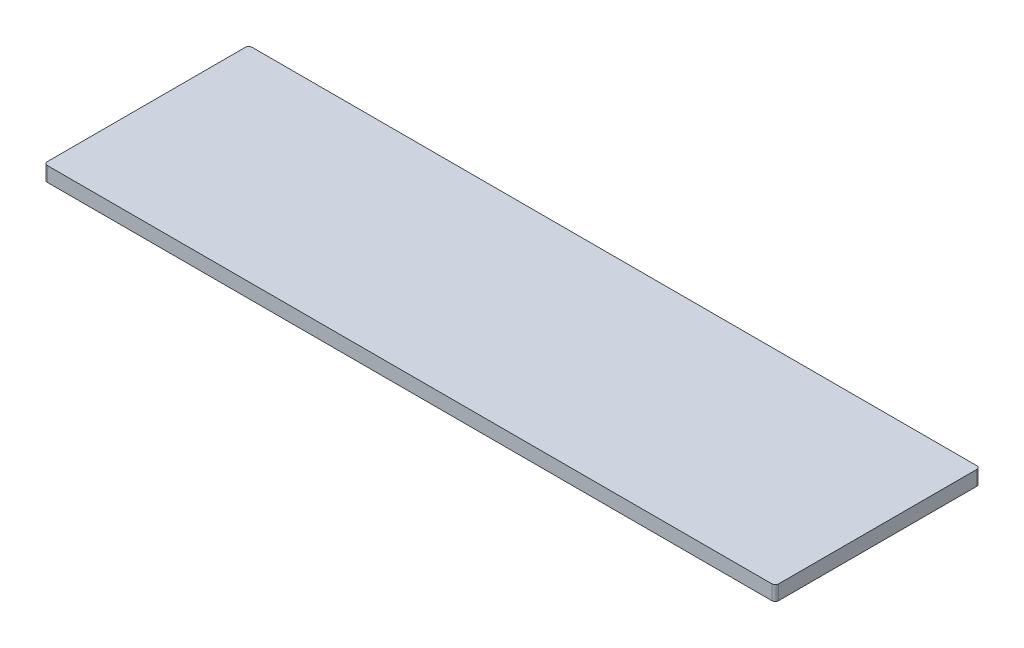
ISO-10303-21;
HEADER;
FILE_DESCRIPTION(('STEP AP214'),'2;1');
FILE_NAME('part.step','',(''),(''),'','','');
FILE_SCHEMA(('AUTOMOTIVE_DESIGN { 1 0 10303 214 1 1 1 1 }'));
ENDSEC;
DATA;
#1=APPLICATION_CONTEXT('core data for automotive mechanical design processes');
#2=APPLICATION_PROTOCOL_DEFINITION('international standard','automotive_design',2000,#1);
#3=PRODUCT_CONTEXT('',#1,'mechanical');
#4=PRODUCT('Part','Part','',(#3));
#5=PRODUCT_RELATED_PRODUCT_CATEGORY('part','',(#4));
#6=PRODUCT_DEFINITION_FORMATION('','',#4);
#7=PRODUCT_DEFINITION_CONTEXT('part definition',#1,'design');
#8=PRODUCT_DEFINITION('design','',#6,#7);
#9=PRODUCT_DEFINITION_SHAPE('','',#8);
#10=(LENGTH_UNIT() NAMED_UNIT(*) SI_UNIT(.MILLI.,.METRE.));
#11=(NAMED_UNIT(*) PLANE_ANGLE_UNIT() SI_UNIT($,.RADIAN.));
#12=(NAMED_UNIT(*) SI_UNIT($,.STERADIAN.) SOLID_ANGLE_UNIT());
#13=UNCERTAINTY_MEASURE_WITH_UNIT(LENGTH_MEASURE(1.E-05),#10,'distance_accuracy_value','');
#14=(GEOMETRIC_REPRESENTATION_CONTEXT(3) GLOBAL_UNCERTAINTY_ASSIGNED_CONTEXT((#13)) GLOBAL_UNIT_ASSIGNED_CONTEXT((#10,
#11,#12)) REPRESENTATION_CONTEXT('',''));
#15=CARTESIAN_POINT('',(0.,0.,0.));
#16=DIRECTION('',(0.,0.,1.));
#17=DIRECTION('',(1.,0.,0.));
#18=AXIS2_PLACEMENT_3D('',#15,#16,#17);
#19=CARTESIAN_POINT('',(317.5,12.7,88.9));
#20=DIRECTION('',(-1.,0.,0.));
#21=DIRECTION('',(0.,0.,1.));
#22=AXIS2_PLACEMENT_3D('',#19,#20,#21);
#23=PLANE('',#22);
#24=DIRECTION('',(0.,0.,-1.));
#25=VECTOR('',#24,1.);
#26=CARTESIAN_POINT('',(317.5,0.,88.9));
#27=LINE('',#26,#25);
#28=CARTESIAN_POINT('',(317.5,0.,85.9));
#29=VERTEX_POINT('',#28);
#30=CARTESIAN_POINT('',(317.5,0.,-85.9));
#31=VERTEX_POINT('',#30);
#32=EDGE_CURVE('E182',#29,#31,#27,.T.);
#33=ORIENTED_EDGE('',*,*,#32,.T.);
#34=DIRECTION('',(0.,-1.,0.));
#35=VECTOR('',#34,1.);
#36=CARTESIAN_POINT('',(317.5,12.7,-85.9));
#37=LINE('',#36,#35);
#38=CARTESIAN_POINT('',(317.5,12.7,-85.9));
#39=VERTEX_POINT('',#38);
#40=EDGE_CURVE('E11',#31,#39,#37,.F.);
#41=ORIENTED_EDGE('',*,*,#40,.T.);
#42=DIRECTION('',(0.,0.,-1.));
#43=VECTOR('',#42,1.);
#44=CARTESIAN_POINT('',(317.5,12.7,88.9));
#45=LINE('',#44,#43);
#46=CARTESIAN_POINT('',(317.5,12.7,85.9));
#47=VERTEX_POINT('',#46);
#48=EDGE_CURVE('E135',#47,#39,#45,.T.);
#49=ORIENTED_EDGE('',*,*,#48,.F.);
#50=DIRECTION('',(0.,-1.,0.));
#51=VECTOR('',#50,1.);
#52=CARTESIAN_POINT('',(317.5,12.7,85.9));
#53=LINE('',#52,#51);
#54=EDGE_CURVE('E48',#47,#29,#53,.T.);
#55=ORIENTED_EDGE('',*,*,#54,.T.);
#56=EDGE_LOOP('',(#33,#41,#49,#55));
#57=FACE_BOUND('',#56,.T.);
#58=ADVANCED_FACE('F39',(#57),#23,.F.);
#59=CARTESIAN_POINT('',(-317.5,12.7,-88.9));
#60=DIRECTION('',(0.,0.,1.));
#61=DIRECTION('',(1.,0.,0.));
#62=AXIS2_PLACEMENT_3D('',#59,#60,#61);
#63=PLANE('',#62);
#64=DIRECTION('',(-1.,0.,0.));
#65=VECTOR('',#64,1.);
#66=CARTESIAN_POINT('',(-317.5,0.,-88.9));
#67=LINE('',#66,#65);
#68=CARTESIAN_POINT('',(314.5,0.,-88.9));
#69=VERTEX_POINT('',#68);
#70=CARTESIAN_POINT('',(-314.5,0.,-88.9));
#71=VERTEX_POINT('',#70);
#72=EDGE_CURVE('E142',#69,#71,#67,.T.);
#73=ORIENTED_EDGE('',*,*,#72,.T.);
#74=DIRECTION('',(0.,-1.,0.));
#75=VECTOR('',#74,1.);
#76=CARTESIAN_POINT('',(-314.5,12.7,-88.9));
#77=LINE('',#76,#75);
#78=CARTESIAN_POINT('',(-314.5,12.7,-88.9));
#79=VERTEX_POINT('',#78);
#80=EDGE_CURVE('E55',#71,#79,#77,.F.);
#81=ORIENTED_EDGE('',*,*,#80,.T.);
#82=DIRECTION('',(-1.,0.,0.));
#83=VECTOR('',#82,1.);
#84=CARTESIAN_POINT('',(-317.5,12.7,-88.9));
#85=LINE('',#84,#83);
#86=CARTESIAN_POINT('',(314.5,12.7,-88.9));
#87=VERTEX_POINT('',#86);
#88=EDGE_CURVE('E140',#87,#79,#85,.T.);
#89=ORIENTED_EDGE('',*,*,#88,.F.);
#90=DIRECTION('',(0.,-1.,0.));
#91=VECTOR('',#90,1.);
#92=CARTESIAN_POINT('',(314.5,12.7,-88.9));
#93=LINE('',#92,#91);
#94=EDGE_CURVE('E171',#87,#69,#93,.T.);
#95=ORIENTED_EDGE('',*,*,#94,.T.);
#96=EDGE_LOOP('',(#73,#81,#89,#95));
#97=FACE_BOUND('',#96,.T.);
#98=ADVANCED_FACE('F207',(#97),#63,.F.);
#99=CARTESIAN_POINT('',(-317.5,12.7,88.9));
#100=DIRECTION('',(1.,0.,0.));
#101=DIRECTION('',(0.,0.,-1.));
#102=AXIS2_PLACEMENT_3D('',#99,#100,#101);
#103=PLANE('',#102);
#104=DIRECTION('',(0.,0.,1.));
#105=VECTOR('',#104,1.);
#106=CARTESIAN_POINT('',(-317.5,0.,88.9));
#107=LINE('',#106,#105);
#108=CARTESIAN_POINT('',(-317.5,0.,-85.9));
#109=VERTEX_POINT('',#108);
#110=CARTESIAN_POINT('',(-317.5,0.,85.9));
#111=VERTEX_POINT('',#110);
#112=EDGE_CURVE('E136',#109,#111,#107,.T.);
#113=ORIENTED_EDGE('',*,*,#112,.T.);
#114=DIRECTION('',(0.,-1.,0.));
#115=VECTOR('',#114,1.);
#116=CARTESIAN_POINT('',(-317.5,12.7,85.9));
#117=LINE('',#116,#115);
#118=CARTESIAN_POINT('',(-317.5,12.7,85.9));
#119=VERTEX_POINT('',#118);
#120=EDGE_CURVE('E111',#111,#119,#117,.F.);
#121=ORIENTED_EDGE('',*,*,#120,.T.);
#122=DIRECTION('',(0.,0.,1.));
#123=VECTOR('',#122,1.);
#124=CARTESIAN_POINT('',(-317.5,12.7,88.9));
#125=LINE('',#124,#123);
#126=CARTESIAN_POINT('',(-317.5,12.7,-85.9));
#127=VERTEX_POINT('',#126);
#128=EDGE_CURVE('E193',#127,#119,#125,.T.);
#129=ORIENTED_EDGE('',*,*,#128,.F.);
#130=DIRECTION('',(0.,-1.,0.));
#131=VECTOR('',#130,1.);
#132=CARTESIAN_POINT('',(-317.5,12.7,-85.9));
#133=LINE('',#132,#131);
#134=EDGE_CURVE('E117',#127,#109,#133,.T.);
#135=ORIENTED_EDGE('',*,*,#134,.T.);
#136=EDGE_LOOP('',(#113,#121,#129,#135));
#137=FACE_BOUND('',#136,.T.);
#138=ADVANCED_FACE('F206',(#137),#103,.F.);
#139=CARTESIAN_POINT('',(-317.5,12.7,88.9));
#140=DIRECTION('',(0.,0.,-1.));
#141=DIRECTION('',(-1.,0.,0.));
#142=AXIS2_PLACEMENT_3D('',#139,#140,#141);
#143=PLANE('',#142);
#144=DIRECTION('',(1.,0.,0.));
#145=VECTOR('',#144,1.);
#146=CARTESIAN_POINT('',(-317.5,12.7,88.9));
#147=LINE('',#146,#145);
#148=CARTESIAN_POINT('',(-314.5,12.7,88.9));
#149=VERTEX_POINT('',#148);
#150=CARTESIAN_POINT('',(314.5,12.7,88.9));
#151=VERTEX_POINT('',#150);
#152=EDGE_CURVE('E127',#149,#151,#147,.T.);
#153=ORIENTED_EDGE('',*,*,#152,.F.);
#154=DIRECTION('',(0.,-1.,0.));
#155=VECTOR('',#154,1.);
#156=CARTESIAN_POINT('',(-314.5,12.7,88.9));
#157=LINE('',#156,#155);
#158=CARTESIAN_POINT('',(-314.5,0.,88.9));
#159=VERTEX_POINT('',#158);
#160=EDGE_CURVE('E110',#149,#159,#157,.T.);
#161=ORIENTED_EDGE('',*,*,#160,.T.);
#162=DIRECTION('',(1.,0.,0.));
#163=VECTOR('',#162,1.);
#164=CARTESIAN_POINT('',(-317.5,0.,88.9));
#165=LINE('',#164,#163);
#166=CARTESIAN_POINT('',(314.5,0.,88.9));
#167=VERTEX_POINT('',#166);
#168=EDGE_CURVE('E124',#159,#167,#165,.T.);
#169=ORIENTED_EDGE('',*,*,#168,.T.);
#170=DIRECTION('',(0.,-1.,0.));
#171=VECTOR('',#170,1.);
#172=CARTESIAN_POINT('',(314.5,12.7,88.9));
#173=LINE('',#172,#171);
#174=EDGE_CURVE('E130',#167,#151,#173,.F.);
#175=ORIENTED_EDGE('',*,*,#174,.T.);
#176=EDGE_LOOP('',(#153,#161,#169,#175));
#177=FACE_BOUND('',#176,.T.);
#178=ADVANCED_FACE('F123',(#177),#143,.F.);
#179=CARTESIAN_POINT('',(0.,12.7,0.));
#180=DIRECTION('',(0.,-1.,0.));
#181=DIRECTION('',(0.,0.,-1.));
#182=AXIS2_PLACEMENT_3D('',#179,#180,#181);
#183=PLANE('',#182);
#184=ORIENTED_EDGE('',*,*,#128,.T.);
#185=CARTESIAN_POINT('',(-314.5,12.7,85.9));
#186=DIRECTION('',(0.,-1.,0.));
#187=DIRECTION('',(0.,0.,-1.));
#188=AXIS2_PLACEMENT_3D('',#185,#186,#187);
#189=CIRCLE('',#188,3.);
#190=EDGE_CURVE('E168',#119,#149,#189,.F.);
#191=ORIENTED_EDGE('',*,*,#190,.T.);
#192=ORIENTED_EDGE('',*,*,#152,.T.);
#193=CARTESIAN_POINT('',(314.5,12.7,85.9));
#194=DIRECTION('',(0.,-1.,0.));
#195=DIRECTION('',(0.,0.,-1.));
#196=AXIS2_PLACEMENT_3D('',#193,#194,#195);
#197=CIRCLE('',#196,3.);
#198=EDGE_CURVE('E160',#151,#47,#197,.F.);
#199=ORIENTED_EDGE('',*,*,#198,.T.);
#200=ORIENTED_EDGE('',*,*,#48,.T.);
#201=CARTESIAN_POINT('',(314.5,12.7,-85.9));
#202=DIRECTION('',(0.,-1.,0.));
#203=DIRECTION('',(0.,0.,-1.));
#204=AXIS2_PLACEMENT_3D('',#201,#202,#203);
#205=CIRCLE('',#204,3.);
#206=EDGE_CURVE('E62',#39,#87,#205,.F.);
#207=ORIENTED_EDGE('',*,*,#206,.T.);
#208=ORIENTED_EDGE('',*,*,#88,.T.);
#209=CARTESIAN_POINT('',(-314.5,12.7,-85.9));
#210=DIRECTION('',(0.,-1.,0.));
#211=DIRECTION('',(0.,0.,-1.));
#212=AXIS2_PLACEMENT_3D('',#209,#210,#211);
#213=CIRCLE('',#212,3.);
#214=EDGE_CURVE('E165',#79,#127,#213,.F.);
#215=ORIENTED_EDGE('',*,*,#214,.T.);
#216=EDGE_LOOP('',(#184,#191,#192,#199,#200,#207,#208,#215));
#217=FACE_BOUND('',#216,.T.);
#218=ADVANCED_FACE('F199',(#217),#183,.F.);
#219=CARTESIAN_POINT('',(0.,0.,0.));
#220=DIRECTION('',(0.,-1.,0.));
#221=DIRECTION('',(0.,0.,-1.));
#222=AXIS2_PLACEMENT_3D('',#219,#220,#221);
#223=PLANE('',#222);
#224=ORIENTED_EDGE('',*,*,#168,.F.);
#225=CARTESIAN_POINT('',(-314.5,0.,85.9));
#226=DIRECTION('',(0.,-1.,0.));
#227=DIRECTION('',(0.,0.,-1.));
#228=AXIS2_PLACEMENT_3D('',#225,#226,#227);
#229=CIRCLE('',#228,3.);
#230=EDGE_CURVE('E106',#159,#111,#229,.T.);
#231=ORIENTED_EDGE('',*,*,#230,.T.);
#232=ORIENTED_EDGE('',*,*,#112,.F.);
#233=CARTESIAN_POINT('',(-314.5,0.,-85.9));
#234=DIRECTION('',(0.,-1.,0.));
#235=DIRECTION('',(0.,0.,-1.));
#236=AXIS2_PLACEMENT_3D('',#233,#234,#235);
#237=CIRCLE('',#236,3.);
#238=EDGE_CURVE('E118',#109,#71,#237,.T.);
#239=ORIENTED_EDGE('',*,*,#238,.T.);
#240=ORIENTED_EDGE('',*,*,#72,.F.);
#241=CARTESIAN_POINT('',(314.5,0.,-85.9));
#242=DIRECTION('',(0.,-1.,0.));
#243=DIRECTION('',(0.,0.,-1.));
#244=AXIS2_PLACEMENT_3D('',#241,#242,#243);
#245=CIRCLE('',#244,3.);
#246=EDGE_CURVE('E150',#69,#31,#245,.T.);
#247=ORIENTED_EDGE('',*,*,#246,.T.);
#248=ORIENTED_EDGE('',*,*,#32,.F.);
#249=CARTESIAN_POINT('',(314.5,0.,85.9));
#250=DIRECTION('',(0.,-1.,0.));
#251=DIRECTION('',(0.,0.,-1.));
#252=AXIS2_PLACEMENT_3D('',#249,#250,#251);
#253=CIRCLE('',#252,3.);
#254=EDGE_CURVE('E129',#29,#167,#253,.T.);
#255=ORIENTED_EDGE('',*,*,#254,.T.);
#256=EDGE_LOOP('',(#224,#231,#232,#239,#240,#247,#248,#255));
#257=FACE_BOUND('',#256,.T.);
#258=ADVANCED_FACE('F132',(#257),#223,.T.);
#259=CARTESIAN_POINT('',(-314.5,12.7,85.9));
#260=DIRECTION('',(0.,-1.,0.));
#261=DIRECTION('',(0.,0.,-1.));
#262=AXIS2_PLACEMENT_3D('',#259,#260,#261);
#263=CYLINDRICAL_SURFACE('',#262,3.);
#264=ORIENTED_EDGE('',*,*,#190,.F.);
#265=ORIENTED_EDGE('',*,*,#120,.F.);
#266=ORIENTED_EDGE('',*,*,#230,.F.);
#267=ORIENTED_EDGE('',*,*,#160,.F.);
#268=EDGE_LOOP('',(#264,#265,#266,#267));
#269=FACE_BOUND('',#268,.T.);
#270=ADVANCED_FACE('F109',(#269),#263,.T.);
#271=CARTESIAN_POINT('',(-314.5,12.7,-85.9));
#272=DIRECTION('',(0.,-1.,0.));
#273=DIRECTION('',(0.,0.,-1.));
#274=AXIS2_PLACEMENT_3D('',#271,#272,#273);
#275=CYLINDRICAL_SURFACE('',#274,3.);
#276=ORIENTED_EDGE('',*,*,#214,.F.);
#277=ORIENTED_EDGE('',*,*,#80,.F.);
#278=ORIENTED_EDGE('',*,*,#238,.F.);
#279=ORIENTED_EDGE('',*,*,#134,.F.);
#280=EDGE_LOOP('',(#276,#277,#278,#279));
#281=FACE_BOUND('',#280,.T.);
#282=ADVANCED_FACE('F204',(#281),#275,.T.);
#283=CARTESIAN_POINT('',(314.5,12.7,-85.9));
#284=DIRECTION('',(0.,-1.,0.));
#285=DIRECTION('',(0.,0.,-1.));
#286=AXIS2_PLACEMENT_3D('',#283,#284,#285);
#287=CYLINDRICAL_SURFACE('',#286,3.);
#288=ORIENTED_EDGE('',*,*,#206,.F.);
#289=ORIENTED_EDGE('',*,*,#40,.F.);
#290=ORIENTED_EDGE('',*,*,#246,.F.);
#291=ORIENTED_EDGE('',*,*,#94,.F.);
#292=EDGE_LOOP('',(#288,#289,#290,#291));
#293=FACE_BOUND('',#292,.T.);
#294=ADVANCED_FACE('F209',(#293),#287,.T.);
#295=CARTESIAN_POINT('',(314.5,12.7,85.9));
#296=DIRECTION('',(0.,-1.,0.));
#297=DIRECTION('',(0.,0.,-1.));
#298=AXIS2_PLACEMENT_3D('',#295,#296,#297);
#299=CYLINDRICAL_SURFACE('',#298,3.);
#300=ORIENTED_EDGE('',*,*,#198,.F.);
#301=ORIENTED_EDGE('',*,*,#174,.F.);
#302=ORIENTED_EDGE('',*,*,#254,.F.);
#303=ORIENTED_EDGE('',*,*,#54,.F.);
#304=EDGE_LOOP('',(#300,#301,#302,#303));
#305=FACE_BOUND('',#304,.T.);
#306=ADVANCED_FACE('F41',(#305),#299,.T.);
#307=CLOSED_SHELL('',(#58,#98,#138,#178,#218,#258,#270,#282,#294,#306));
#308=MANIFOLD_SOLID_BREP('B2',#307);
#309=ADVANCED_BREP_SHAPE_REPRESENTATION('',(#18,#308),#14);
#310=SHAPE_DEFINITION_REPRESENTATION(#9,#309);
ENDSEC;
END-ISO-10303-21;
